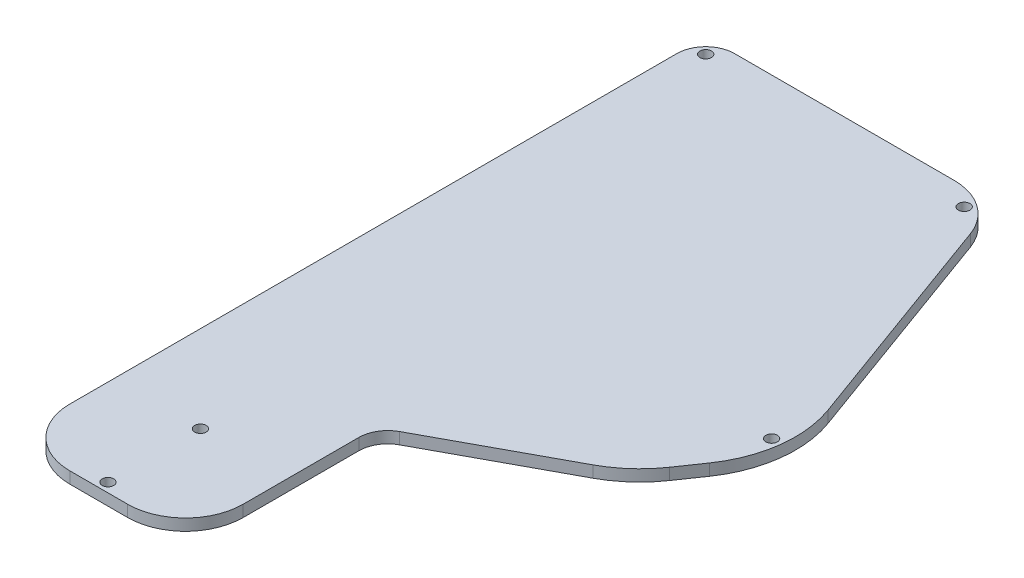
ISO-10303-21;
HEADER;
FILE_DESCRIPTION(('STEP AP214'),'2;1');
FILE_NAME('part.step','',(''),(''),'','','');
FILE_SCHEMA(('AUTOMOTIVE_DESIGN { 1 0 10303 214 1 1 1 1 }'));
ENDSEC;
DATA;
#1=APPLICATION_CONTEXT('core data for automotive mechanical design processes');
#2=APPLICATION_PROTOCOL_DEFINITION('international standard','automotive_design',2000,#1);
#3=PRODUCT_CONTEXT('',#1,'mechanical');
#4=PRODUCT('Part','Part','',(#3));
#5=PRODUCT_RELATED_PRODUCT_CATEGORY('part','',(#4));
#6=PRODUCT_DEFINITION_FORMATION('','',#4);
#7=PRODUCT_DEFINITION_CONTEXT('part definition',#1,'design');
#8=PRODUCT_DEFINITION('design','',#6,#7);
#9=PRODUCT_DEFINITION_SHAPE('','',#8);
#10=(LENGTH_UNIT() NAMED_UNIT(*) SI_UNIT(.MILLI.,.METRE.));
#11=(NAMED_UNIT(*) PLANE_ANGLE_UNIT() SI_UNIT($,.RADIAN.));
#12=(NAMED_UNIT(*) SI_UNIT($,.STERADIAN.) SOLID_ANGLE_UNIT());
#13=UNCERTAINTY_MEASURE_WITH_UNIT(LENGTH_MEASURE(1.E-05),#10,'distance_accuracy_value','');
#14=(GEOMETRIC_REPRESENTATION_CONTEXT(3) GLOBAL_UNCERTAINTY_ASSIGNED_CONTEXT((#13)) GLOBAL_UNIT_ASSIGNED_CONTEXT((#10,
#11,#12)) REPRESENTATION_CONTEXT('',''));
#15=CARTESIAN_POINT('',(0.,0.,0.));
#16=DIRECTION('',(0.,0.,1.));
#17=DIRECTION('',(1.,0.,0.));
#18=AXIS2_PLACEMENT_3D('',#15,#16,#17);
#19=CARTESIAN_POINT('',(25.4,2.54,-12.7));
#20=DIRECTION('',(0.,-1.,0.));
#21=DIRECTION('',(0.,0.,-1.));
#22=AXIS2_PLACEMENT_3D('',#19,#20,#21);
#23=CYLINDRICAL_SURFACE('',#22,12.7);
#24=CARTESIAN_POINT('',(25.4,0.,-12.7));
#25=DIRECTION('',(0.,1.,0.));
#26=DIRECTION('',(0.,0.,1.));
#27=AXIS2_PLACEMENT_3D('',#24,#25,#26);
#28=CIRCLE('',#27,12.7);
#29=CARTESIAN_POINT('',(25.3999999999999,0.,0.));
#30=VERTEX_POINT('',#29);
#31=CARTESIAN_POINT('',(38.1,0.,-12.7000000000001));
#32=VERTEX_POINT('',#31);
#33=EDGE_CURVE('E175',#30,#32,#28,.T.);
#34=ORIENTED_EDGE('',*,*,#33,.T.);
#35=DIRECTION('',(0.,-1.,0.));
#36=VECTOR('',#35,1.);
#37=CARTESIAN_POINT('',(38.1,2.54,-12.7000000000001));
#38=LINE('',#37,#36);
#39=CARTESIAN_POINT('',(38.1,2.54,-12.7000000000001));
#40=VERTEX_POINT('',#39);
#41=EDGE_CURVE('E11',#40,#32,#38,.T.);
#42=ORIENTED_EDGE('',*,*,#41,.F.);
#43=CARTESIAN_POINT('',(25.4,2.54,-12.7));
#44=DIRECTION('',(0.,1.,0.));
#45=DIRECTION('',(0.,0.,1.));
#46=AXIS2_PLACEMENT_3D('',#43,#44,#45);
#47=CIRCLE('',#46,12.7);
#48=CARTESIAN_POINT('',(25.3999999999999,2.54,0.));
#49=VERTEX_POINT('',#48);
#50=EDGE_CURVE('E202',#49,#40,#47,.T.);
#51=ORIENTED_EDGE('',*,*,#50,.F.);
#52=DIRECTION('',(0.,-1.,0.));
#53=VECTOR('',#52,1.);
#54=CARTESIAN_POINT('',(25.3999999999999,2.54,0.));
#55=LINE('',#54,#53);
#56=EDGE_CURVE('E171',#49,#30,#55,.T.);
#57=ORIENTED_EDGE('',*,*,#56,.T.);
#58=EDGE_LOOP('',(#34,#42,#51,#57));
#59=FACE_BOUND('',#58,.T.);
#60=ADVANCED_FACE('F43',(#59),#23,.T.);
#61=CARTESIAN_POINT('',(38.1,2.54,-12.7000000000001));
#62=DIRECTION('',(-1.,0.,0.));
#63=DIRECTION('',(0.,0.,1.));
#64=AXIS2_PLACEMENT_3D('',#61,#62,#63);
#65=PLANE('',#64);
#66=DIRECTION('',(0.,0.,-1.));
#67=VECTOR('',#66,1.);
#68=CARTESIAN_POINT('',(38.1,0.,-12.7000000000001));
#69=LINE('',#68,#67);
#70=CARTESIAN_POINT('',(38.1,0.,-38.1));
#71=VERTEX_POINT('',#70);
#72=EDGE_CURVE('E178',#32,#71,#69,.T.);
#73=ORIENTED_EDGE('',*,*,#72,.T.);
#74=DIRECTION('',(0.,-1.,0.));
#75=VECTOR('',#74,1.);
#76=CARTESIAN_POINT('',(38.1,2.54,-38.1));
#77=LINE('',#76,#75);
#78=CARTESIAN_POINT('',(38.1,2.54,-38.1));
#79=VERTEX_POINT('',#78);
#80=EDGE_CURVE('E51',#79,#71,#77,.T.);
#81=ORIENTED_EDGE('',*,*,#80,.F.);
#82=DIRECTION('',(0.,0.,-1.));
#83=VECTOR('',#82,1.);
#84=CARTESIAN_POINT('',(38.1,2.54,-12.7000000000001));
#85=LINE('',#84,#83);
#86=EDGE_CURVE('E120',#40,#79,#85,.T.);
#87=ORIENTED_EDGE('',*,*,#86,.F.);
#88=ORIENTED_EDGE('',*,*,#41,.T.);
#89=EDGE_LOOP('',(#73,#81,#87,#88));
#90=FACE_BOUND('',#89,.T.);
#91=ADVANCED_FACE('F291',(#90),#65,.F.);
#92=CARTESIAN_POINT('',(44.45,2.54,-38.1));
#93=DIRECTION('',(0.,-1.,0.));
#94=DIRECTION('',(0.,0.,-1.));
#95=AXIS2_PLACEMENT_3D('',#92,#93,#94);
#96=CYLINDRICAL_SURFACE('',#95,6.35);
#97=CARTESIAN_POINT('',(44.45,0.,-38.1));
#98=DIRECTION('',(0.,-1.,0.));
#99=DIRECTION('',(0.,0.,1.));
#100=AXIS2_PLACEMENT_3D('',#97,#98,#99);
#101=CIRCLE('',#100,6.35);
#102=CARTESIAN_POINT('',(41.4326368316291,0.,-43.6873087895836));
#103=VERTEX_POINT('',#102);
#104=EDGE_CURVE('E181',#71,#103,#101,.T.);
#105=ORIENTED_EDGE('',*,*,#104,.T.);
#106=DIRECTION('',(0.,-1.,0.));
#107=VECTOR('',#106,1.);
#108=CARTESIAN_POINT('',(41.4326368316291,2.54,-43.6873087895836));
#109=LINE('',#108,#107);
#110=CARTESIAN_POINT('',(41.4326368316291,2.54,-43.6873087895836));
#111=VERTEX_POINT('',#110);
#112=EDGE_CURVE('E227',#111,#103,#109,.T.);
#113=ORIENTED_EDGE('',*,*,#112,.F.);
#114=CARTESIAN_POINT('',(44.45,2.54,-38.1));
#115=DIRECTION('',(0.,-1.,0.));
#116=DIRECTION('',(0.,0.,1.));
#117=AXIS2_PLACEMENT_3D('',#114,#115,#116);
#118=CIRCLE('',#117,6.35);
#119=EDGE_CURVE('E235',#79,#111,#118,.T.);
#120=ORIENTED_EDGE('',*,*,#119,.F.);
#121=ORIENTED_EDGE('',*,*,#80,.T.);
#122=EDGE_LOOP('',(#105,#113,#120,#121));
#123=FACE_BOUND('',#122,.T.);
#124=ADVANCED_FACE('F233',(#123),#96,.F.);
#125=CARTESIAN_POINT('',(69.0224596820206,2.54,-58.5868818086818));
#126=DIRECTION('',(-0.475175302105661,0.,-0.879891147965925));
#127=DIRECTION('',(-0.879891147965926,0.,0.475175302105661));
#128=AXIS2_PLACEMENT_3D('',#125,#126,#127);
#129=PLANE('',#128);
#130=DIRECTION('',(0.879891147965925,0.,-0.475175302105661));
#131=VECTOR('',#130,1.);
#132=CARTESIAN_POINT('',(69.0224596820206,0.,-58.5868818086818));
#133=LINE('',#132,#131);
#134=CARTESIAN_POINT('',(69.0224596820206,0.,-58.5868818086818));
#135=VERTEX_POINT('',#134);
#136=EDGE_CURVE('E183',#103,#135,#133,.T.);
#137=ORIENTED_EDGE('',*,*,#136,.T.);
#138=DIRECTION('',(0.,-1.,0.));
#139=VECTOR('',#138,1.);
#140=CARTESIAN_POINT('',(69.0224596820206,2.54,-58.5868818086818));
#141=LINE('',#140,#139);
#142=CARTESIAN_POINT('',(69.0224596820206,2.54,-58.5868818086818));
#143=VERTEX_POINT('',#142);
#144=EDGE_CURVE('E224',#143,#135,#141,.T.);
#145=ORIENTED_EDGE('',*,*,#144,.F.);
#146=DIRECTION('',(0.879891147965925,0.,-0.475175302105661));
#147=VECTOR('',#146,1.);
#148=CARTESIAN_POINT('',(69.0224596820206,2.54,-58.5868818086818));
#149=LINE('',#148,#147);
#150=EDGE_CURVE('E253',#111,#143,#149,.T.);
#151=ORIENTED_EDGE('',*,*,#150,.F.);
#152=ORIENTED_EDGE('',*,*,#112,.T.);
#153=EDGE_LOOP('',(#137,#145,#151,#152));
#154=FACE_BOUND('',#153,.T.);
#155=ADVANCED_FACE('F244',(#154),#129,.F.);
#156=CARTESIAN_POINT('',(56.9530070085368,2.54,-80.9361169670163));
#157=DIRECTION('',(0.,-1.,0.));
#158=DIRECTION('',(0.,0.,-1.));
#159=AXIS2_PLACEMENT_3D('',#156,#157,#158);
#160=CYLINDRICAL_SURFACE('',#159,25.4);
#161=CARTESIAN_POINT('',(56.9530070085368,0.,-80.9361169670163));
#162=DIRECTION('',(0.,1.,0.));
#163=DIRECTION('',(0.,0.,-1.));
#164=AXIS2_PLACEMENT_3D('',#161,#162,#163);
#165=CIRCLE('',#164,25.4);
#166=CARTESIAN_POINT('',(77.8752649706461,0.,-66.5340642741897));
#167=VERTEX_POINT('',#166);
#168=EDGE_CURVE('E185',#135,#167,#165,.T.);
#169=ORIENTED_EDGE('',*,*,#168,.T.);
#170=DIRECTION('',(0.,-1.,0.));
#171=VECTOR('',#170,1.);
#172=CARTESIAN_POINT('',(77.8752649706461,2.54,-66.5340642741897));
#173=LINE('',#172,#171);
#174=CARTESIAN_POINT('',(77.8752649706461,2.54,-66.5340642741897));
#175=VERTEX_POINT('',#174);
#176=EDGE_CURVE('E221',#175,#167,#173,.T.);
#177=ORIENTED_EDGE('',*,*,#176,.F.);
#178=CARTESIAN_POINT('',(56.9530070085368,2.54,-80.9361169670163));
#179=DIRECTION('',(0.,1.,0.));
#180=DIRECTION('',(0.,0.,-1.));
#181=AXIS2_PLACEMENT_3D('',#178,#179,#180);
#182=CIRCLE('',#181,25.4);
#183=EDGE_CURVE('E250',#143,#175,#182,.T.);
#184=ORIENTED_EDGE('',*,*,#183,.F.);
#185=ORIENTED_EDGE('',*,*,#144,.T.);
#186=EDGE_LOOP('',(#169,#177,#184,#185));
#187=FACE_BOUND('',#186,.T.);
#188=ADVANCED_FACE('F248',(#187),#160,.T.);
#189=CARTESIAN_POINT('',(81.4757781438528,2.54,-71.764628764717));
#190=DIRECTION('',(-0.823710943390129,0.,-0.567009948536481));
#191=DIRECTION('',(-0.567009948536481,0.,0.823710943390129));
#192=AXIS2_PLACEMENT_3D('',#189,#190,#191);
#193=PLANE('',#192);
#194=DIRECTION('',(0.567009948536481,0.,-0.823710943390129));
#195=VECTOR('',#194,1.);
#196=CARTESIAN_POINT('',(81.4757781438528,0.,-71.764628764717));
#197=LINE('',#196,#195);
#198=CARTESIAN_POINT('',(81.4757781438528,0.,-71.764628764717));
#199=VERTEX_POINT('',#198);
#200=EDGE_CURVE('E187',#167,#199,#197,.T.);
#201=ORIENTED_EDGE('',*,*,#200,.T.);
#202=DIRECTION('',(0.,-1.,0.));
#203=VECTOR('',#202,1.);
#204=CARTESIAN_POINT('',(81.4757781438528,2.54,-71.764628764717));
#205=LINE('',#204,#203);
#206=CARTESIAN_POINT('',(81.4757781438528,2.54,-71.764628764717));
#207=VERTEX_POINT('',#206);
#208=EDGE_CURVE('E218',#207,#199,#205,.T.);
#209=ORIENTED_EDGE('',*,*,#208,.F.);
#210=DIRECTION('',(0.567009948536481,0.,-0.823710943390129));
#211=VECTOR('',#210,1.);
#212=CARTESIAN_POINT('',(81.4757781438528,2.54,-71.764628764717));
#213=LINE('',#212,#211);
#214=EDGE_CURVE('E252',#175,#207,#213,.T.);
#215=ORIENTED_EDGE('',*,*,#214,.F.);
#216=ORIENTED_EDGE('',*,*,#176,.T.);
#217=EDGE_LOOP('',(#201,#209,#215,#216));
#218=FACE_BOUND('',#217,.T.);
#219=ADVANCED_FACE('F304',(#218),#193,.F.);
#220=CARTESIAN_POINT('',(60.5535201817435,2.54,-86.1666814575436));
#221=DIRECTION('',(0.,-1.,0.));
#222=DIRECTION('',(0.,0.,-1.));
#223=AXIS2_PLACEMENT_3D('',#220,#221,#222);
#224=CYLINDRICAL_SURFACE('',#223,25.4);
#225=CARTESIAN_POINT('',(60.5535201817435,0.,-86.1666814575436));
#226=DIRECTION('',(0.,1.,0.));
#227=DIRECTION('',(0.,0.,-1.));
#228=AXIS2_PLACEMENT_3D('',#225,#226,#227);
#229=CIRCLE('',#228,25.4);
#230=CARTESIAN_POINT('',(84.4217127497056,0.,-94.8539930980156));
#231=VERTEX_POINT('',#230);
#232=EDGE_CURVE('E189',#199,#231,#229,.T.);
#233=ORIENTED_EDGE('',*,*,#232,.T.);
#234=DIRECTION('',(0.,-1.,0.));
#235=VECTOR('',#234,1.);
#236=CARTESIAN_POINT('',(84.4217127497056,2.54,-94.8539930980156));
#237=LINE('',#236,#235);
#238=CARTESIAN_POINT('',(84.4217127497056,2.54,-94.8539930980156));
#239=VERTEX_POINT('',#238);
#240=EDGE_CURVE('E215',#239,#231,#237,.T.);
#241=ORIENTED_EDGE('',*,*,#240,.F.);
#242=CARTESIAN_POINT('',(60.5535201817435,2.54,-86.1666814575436));
#243=DIRECTION('',(0.,1.,0.));
#244=DIRECTION('',(0.,0.,-1.));
#245=AXIS2_PLACEMENT_3D('',#242,#243,#244);
#246=CIRCLE('',#245,25.4);
#247=EDGE_CURVE('E255',#207,#239,#246,.T.);
#248=ORIENTED_EDGE('',*,*,#247,.F.);
#249=ORIENTED_EDGE('',*,*,#208,.T.);
#250=EDGE_LOOP('',(#233,#241,#248,#249));
#251=FACE_BOUND('',#250,.T.);
#252=ADVANCED_FACE('F307',(#251),#224,.T.);
#253=CARTESIAN_POINT('',(66.5181396852237,2.54,-144.043655820236));
#254=DIRECTION('',(-0.939692620785909,0.,0.342020143325666));
#255=DIRECTION('',(0.342020143325666,0.,0.93969262078591));
#256=AXIS2_PLACEMENT_3D('',#253,#254,#255);
#257=PLANE('',#256);
#258=DIRECTION('',(-0.342020143325666,0.,-0.939692620785909));
#259=VECTOR('',#258,1.);
#260=CARTESIAN_POINT('',(66.5181396852237,0.,-144.043655820236));
#261=LINE('',#260,#259);
#262=CARTESIAN_POINT('',(66.5181396852237,0.,-144.043655820236));
#263=VERTEX_POINT('',#262);
#264=EDGE_CURVE('E191',#231,#263,#261,.T.);
#265=ORIENTED_EDGE('',*,*,#264,.T.);
#266=DIRECTION('',(0.,-1.,0.));
#267=VECTOR('',#266,1.);
#268=CARTESIAN_POINT('',(66.5181396852237,2.54,-144.043655820236));
#269=LINE('',#268,#267);
#270=CARTESIAN_POINT('',(66.5181396852237,2.54,-144.043655820236));
#271=VERTEX_POINT('',#270);
#272=EDGE_CURVE('E212',#271,#263,#269,.T.);
#273=ORIENTED_EDGE('',*,*,#272,.F.);
#274=DIRECTION('',(-0.342020143325666,0.,-0.939692620785909));
#275=VECTOR('',#274,1.);
#276=CARTESIAN_POINT('',(66.5181396852237,2.54,-144.043655820236));
#277=LINE('',#276,#275);
#278=EDGE_CURVE('E261',#239,#271,#277,.T.);
#279=ORIENTED_EDGE('',*,*,#278,.F.);
#280=ORIENTED_EDGE('',*,*,#240,.T.);
#281=EDGE_LOOP('',(#265,#273,#279,#280));
#282=FACE_BOUND('',#281,.T.);
#283=ADVANCED_FACE('F311',(#282),#257,.F.);
#284=CARTESIAN_POINT('',(54.5840434012426,2.54,-139.7));
#285=DIRECTION('',(0.,-1.,0.));
#286=DIRECTION('',(0.,0.,-1.));
#287=AXIS2_PLACEMENT_3D('',#284,#285,#286);
#288=CYLINDRICAL_SURFACE('',#287,12.7);
#289=CARTESIAN_POINT('',(54.5840434012426,0.,-139.7));
#290=DIRECTION('',(0.,1.,0.));
#291=DIRECTION('',(0.,0.,-1.));
#292=AXIS2_PLACEMENT_3D('',#289,#290,#291);
#293=CIRCLE('',#292,12.7);
#294=CARTESIAN_POINT('',(54.5840434012426,0.,-152.4));
#295=VERTEX_POINT('',#294);
#296=EDGE_CURVE('E193',#263,#295,#293,.T.);
#297=ORIENTED_EDGE('',*,*,#296,.T.);
#298=DIRECTION('',(0.,-1.,0.));
#299=VECTOR('',#298,1.);
#300=CARTESIAN_POINT('',(54.5840434012426,2.54,-152.4));
#301=LINE('',#300,#299);
#302=CARTESIAN_POINT('',(54.5840434012426,2.54,-152.4));
#303=VERTEX_POINT('',#302);
#304=EDGE_CURVE('E209',#303,#295,#301,.T.);
#305=ORIENTED_EDGE('',*,*,#304,.F.);
#306=CARTESIAN_POINT('',(54.5840434012426,2.54,-139.7));
#307=DIRECTION('',(0.,1.,0.));
#308=DIRECTION('',(0.,0.,-1.));
#309=AXIS2_PLACEMENT_3D('',#306,#307,#308);
#310=CIRCLE('',#309,12.7);
#311=EDGE_CURVE('E263',#271,#303,#310,.T.);
#312=ORIENTED_EDGE('',*,*,#311,.F.);
#313=ORIENTED_EDGE('',*,*,#272,.T.);
#314=EDGE_LOOP('',(#297,#305,#312,#313));
#315=FACE_BOUND('',#314,.T.);
#316=ADVANCED_FACE('F315',(#315),#288,.T.);
#317=CARTESIAN_POINT('',(6.35,2.54,-152.4));
#318=DIRECTION('',(0.,0.,1.));
#319=DIRECTION('',(1.,0.,0.));
#320=AXIS2_PLACEMENT_3D('',#317,#318,#319);
#321=PLANE('',#320);
#322=DIRECTION('',(-1.,0.,0.));
#323=VECTOR('',#322,1.);
#324=CARTESIAN_POINT('',(6.35,0.,-152.4));
#325=LINE('',#324,#323);
#326=CARTESIAN_POINT('',(6.35,0.,-152.4));
#327=VERTEX_POINT('',#326);
#328=EDGE_CURVE('E195',#295,#327,#325,.T.);
#329=ORIENTED_EDGE('',*,*,#328,.T.);
#330=DIRECTION('',(0.,-1.,0.));
#331=VECTOR('',#330,1.);
#332=CARTESIAN_POINT('',(6.35,2.54,-152.4));
#333=LINE('',#332,#331);
#334=CARTESIAN_POINT('',(6.35,2.54,-152.4));
#335=VERTEX_POINT('',#334);
#336=EDGE_CURVE('E206',#335,#327,#333,.T.);
#337=ORIENTED_EDGE('',*,*,#336,.F.);
#338=DIRECTION('',(-1.,0.,0.));
#339=VECTOR('',#338,1.);
#340=CARTESIAN_POINT('',(6.35,2.54,-152.4));
#341=LINE('',#340,#339);
#342=EDGE_CURVE('E265',#303,#335,#341,.T.);
#343=ORIENTED_EDGE('',*,*,#342,.F.);
#344=ORIENTED_EDGE('',*,*,#304,.T.);
#345=EDGE_LOOP('',(#329,#337,#343,#344));
#346=FACE_BOUND('',#345,.T.);
#347=ADVANCED_FACE('F271',(#346),#321,.F.);
#348=CARTESIAN_POINT('',(6.35,2.54,-146.05));
#349=DIRECTION('',(0.,-1.,0.));
#350=DIRECTION('',(0.,0.,-1.));
#351=AXIS2_PLACEMENT_3D('',#348,#349,#350);
#352=CYLINDRICAL_SURFACE('',#351,6.34999999999998);
#353=CARTESIAN_POINT('',(6.35,0.,-146.05));
#354=DIRECTION('',(0.,1.,0.));
#355=DIRECTION('',(0.,0.,-1.));
#356=AXIS2_PLACEMENT_3D('',#353,#354,#355);
#357=CIRCLE('',#356,6.34999999999998);
#358=CARTESIAN_POINT('',(0.,0.,-146.05));
#359=VERTEX_POINT('',#358);
#360=EDGE_CURVE('E197',#327,#359,#357,.T.);
#361=ORIENTED_EDGE('',*,*,#360,.T.);
#362=DIRECTION('',(0.,-1.,0.));
#363=VECTOR('',#362,1.);
#364=CARTESIAN_POINT('',(0.,2.54,-146.05));
#365=LINE('',#364,#363);
#366=CARTESIAN_POINT('',(0.,2.54,-146.05));
#367=VERTEX_POINT('',#366);
#368=EDGE_CURVE('E166',#367,#359,#365,.T.);
#369=ORIENTED_EDGE('',*,*,#368,.F.);
#370=CARTESIAN_POINT('',(6.35,2.54,-146.05));
#371=DIRECTION('',(0.,1.,0.));
#372=DIRECTION('',(0.,0.,-1.));
#373=AXIS2_PLACEMENT_3D('',#370,#371,#372);
#374=CIRCLE('',#373,6.34999999999998);
#375=EDGE_CURVE('E157',#335,#367,#374,.T.);
#376=ORIENTED_EDGE('',*,*,#375,.F.);
#377=ORIENTED_EDGE('',*,*,#336,.T.);
#378=EDGE_LOOP('',(#361,#369,#376,#377));
#379=FACE_BOUND('',#378,.T.);
#380=ADVANCED_FACE('F275',(#379),#352,.T.);
#381=CARTESIAN_POINT('',(0.,2.54,-12.7000000000001));
#382=DIRECTION('',(1.,0.,0.));
#383=DIRECTION('',(0.,0.,-1.));
#384=AXIS2_PLACEMENT_3D('',#381,#382,#383);
#385=PLANE('',#384);
#386=DIRECTION('',(0.,0.,1.));
#387=VECTOR('',#386,1.);
#388=CARTESIAN_POINT('',(0.,0.,-12.7000000000001));
#389=LINE('',#388,#387);
#390=CARTESIAN_POINT('',(0.,0.,-12.7000000000001));
#391=VERTEX_POINT('',#390);
#392=EDGE_CURVE('E165',#359,#391,#389,.T.);
#393=ORIENTED_EDGE('',*,*,#392,.T.);
#394=DIRECTION('',(0.,-1.,0.));
#395=VECTOR('',#394,1.);
#396=CARTESIAN_POINT('',(0.,2.54,-12.7000000000001));
#397=LINE('',#396,#395);
#398=CARTESIAN_POINT('',(0.,2.54,-12.7000000000001));
#399=VERTEX_POINT('',#398);
#400=EDGE_CURVE('E162',#399,#391,#397,.T.);
#401=ORIENTED_EDGE('',*,*,#400,.F.);
#402=DIRECTION('',(0.,0.,1.));
#403=VECTOR('',#402,1.);
#404=CARTESIAN_POINT('',(0.,2.54,-12.7000000000001));
#405=LINE('',#404,#403);
#406=EDGE_CURVE('E151',#367,#399,#405,.T.);
#407=ORIENTED_EDGE('',*,*,#406,.F.);
#408=ORIENTED_EDGE('',*,*,#368,.T.);
#409=EDGE_LOOP('',(#393,#401,#407,#408));
#410=FACE_BOUND('',#409,.T.);
#411=ADVANCED_FACE('F163',(#410),#385,.F.);
#412=CARTESIAN_POINT('',(12.7,2.54,-12.7));
#413=DIRECTION('',(0.,-1.,0.));
#414=DIRECTION('',(0.,0.,-1.));
#415=AXIS2_PLACEMENT_3D('',#412,#413,#414);
#416=CYLINDRICAL_SURFACE('',#415,12.7);
#417=CARTESIAN_POINT('',(12.7,0.,-12.7));
#418=DIRECTION('',(0.,1.,0.));
#419=DIRECTION('',(0.,0.,-1.));
#420=AXIS2_PLACEMENT_3D('',#417,#418,#419);
#421=CIRCLE('',#420,12.7);
#422=CARTESIAN_POINT('',(12.7000000000001,0.,0.));
#423=VERTEX_POINT('',#422);
#424=EDGE_CURVE('E106',#391,#423,#421,.T.);
#425=ORIENTED_EDGE('',*,*,#424,.T.);
#426=DIRECTION('',(0.,-1.,0.));
#427=VECTOR('',#426,1.);
#428=CARTESIAN_POINT('',(12.7000000000001,2.54,0.));
#429=LINE('',#428,#427);
#430=CARTESIAN_POINT('',(12.7000000000001,2.54,0.));
#431=VERTEX_POINT('',#430);
#432=EDGE_CURVE('E167',#431,#423,#429,.T.);
#433=ORIENTED_EDGE('',*,*,#432,.F.);
#434=CARTESIAN_POINT('',(12.7,2.54,-12.7));
#435=DIRECTION('',(0.,1.,0.));
#436=DIRECTION('',(0.,0.,-1.));
#437=AXIS2_PLACEMENT_3D('',#434,#435,#436);
#438=CIRCLE('',#437,12.7);
#439=EDGE_CURVE('E155',#399,#431,#438,.T.);
#440=ORIENTED_EDGE('',*,*,#439,.F.);
#441=ORIENTED_EDGE('',*,*,#400,.T.);
#442=EDGE_LOOP('',(#425,#433,#440,#441));
#443=FACE_BOUND('',#442,.T.);
#444=ADVANCED_FACE('F169',(#443),#416,.T.);
#445=CARTESIAN_POINT('',(12.7000000000001,2.54,0.));
#446=DIRECTION('',(0.,0.,-1.));
#447=DIRECTION('',(-1.,0.,0.));
#448=AXIS2_PLACEMENT_3D('',#445,#446,#447);
#449=PLANE('',#448);
#450=DIRECTION('',(1.,0.,0.));
#451=VECTOR('',#450,1.);
#452=CARTESIAN_POINT('',(12.7000000000001,0.,0.));
#453=LINE('',#452,#451);
#454=EDGE_CURVE('E112',#423,#30,#453,.T.);
#455=ORIENTED_EDGE('',*,*,#454,.T.);
#456=ORIENTED_EDGE('',*,*,#56,.F.);
#457=DIRECTION('',(1.,0.,0.));
#458=VECTOR('',#457,1.);
#459=CARTESIAN_POINT('',(12.7000000000001,2.54,0.));
#460=LINE('',#459,#458);
#461=EDGE_CURVE('E59',#431,#49,#460,.T.);
#462=ORIENTED_EDGE('',*,*,#461,.F.);
#463=ORIENTED_EDGE('',*,*,#432,.T.);
#464=EDGE_LOOP('',(#455,#456,#462,#463));
#465=FACE_BOUND('',#464,.T.);
#466=ADVANCED_FACE('F279',(#465),#449,.F.);
#467=CARTESIAN_POINT('',(25.4,2.54,-12.7));
#468=DIRECTION('',(0.,1.,0.));
#469=DIRECTION('',(0.,0.,1.));
#470=AXIS2_PLACEMENT_3D('',#467,#468,#469);
#471=PLANE('',#470);
#472=CARTESIAN_POINT('',(3.302,2.54,-149.098));
#473=DIRECTION('',(0.,1.,0.));
#474=DIRECTION('',(0.,0.,1.));
#475=AXIS2_PLACEMENT_3D('',#472,#473,#474);
#476=CIRCLE('',#475,1.27000000000001);
#477=CARTESIAN_POINT('',(3.302,2.54,-147.828));
#478=VERTEX_POINT('',#477);
#479=EDGE_CURVE('E179',#478,#478,#476,.T.);
#480=ORIENTED_EDGE('',*,*,#479,.F.);
#481=EDGE_LOOP('',(#480));
#482=FACE_BOUND('',#481,.T.);
#483=CARTESIAN_POINT('',(60.7199620585743,2.54,-148.463));
#484=DIRECTION('',(0.,1.,0.));
#485=DIRECTION('',(0.,0.,1.));
#486=AXIS2_PLACEMENT_3D('',#483,#484,#485);
#487=CIRCLE('',#486,1.26999999999999);
#488=CARTESIAN_POINT('',(60.7199620585743,2.54,-147.193));
#489=VERTEX_POINT('',#488);
#490=EDGE_CURVE('E519',#489,#489,#487,.T.);
#491=ORIENTED_EDGE('',*,*,#490,.F.);
#492=EDGE_LOOP('',(#491));
#493=FACE_BOUND('',#492,.T.);
#494=CARTESIAN_POINT('',(83.6559012336225,2.54,-83.2190860696456));
#495=DIRECTION('',(0.,1.,0.));
#496=DIRECTION('',(0.,0.,1.));
#497=AXIS2_PLACEMENT_3D('',#494,#495,#496);
#498=CIRCLE('',#497,1.26999999999999);
#499=CARTESIAN_POINT('',(83.6559012336225,2.54,-81.9490860696456));
#500=VERTEX_POINT('',#499);
#501=EDGE_CURVE('E527',#500,#500,#498,.T.);
#502=ORIENTED_EDGE('',*,*,#501,.F.);
#503=EDGE_LOOP('',(#502));
#504=FACE_BOUND('',#503,.T.);
#505=CARTESIAN_POINT('',(19.05,2.54,-22.352));
#506=DIRECTION('',(0.,1.,0.));
#507=DIRECTION('',(0.,0.,1.));
#508=AXIS2_PLACEMENT_3D('',#505,#506,#507);
#509=CIRCLE('',#508,1.27);
#510=CARTESIAN_POINT('',(19.05,2.54,-21.082));
#511=VERTEX_POINT('',#510);
#512=EDGE_CURVE('E533',#511,#511,#509,.T.);
#513=ORIENTED_EDGE('',*,*,#512,.F.);
#514=EDGE_LOOP('',(#513));
#515=FACE_BOUND('',#514,.T.);
#516=CARTESIAN_POINT('',(19.05,2.54,-2.032));
#517=DIRECTION('',(0.,1.,0.));
#518=DIRECTION('',(0.,0.,1.));
#519=AXIS2_PLACEMENT_3D('',#516,#517,#518);
#520=CIRCLE('',#519,1.27);
#521=CARTESIAN_POINT('',(19.05,2.54,-0.761999999999999));
#522=VERTEX_POINT('',#521);
#523=EDGE_CURVE('E539',#522,#522,#520,.T.);
#524=ORIENTED_EDGE('',*,*,#523,.F.);
#525=EDGE_LOOP('',(#524));
#526=FACE_BOUND('',#525,.T.);
#527=ORIENTED_EDGE('',*,*,#50,.T.);
#528=ORIENTED_EDGE('',*,*,#86,.T.);
#529=ORIENTED_EDGE('',*,*,#119,.T.);
#530=ORIENTED_EDGE('',*,*,#150,.T.);
#531=ORIENTED_EDGE('',*,*,#183,.T.);
#532=ORIENTED_EDGE('',*,*,#214,.T.);
#533=ORIENTED_EDGE('',*,*,#247,.T.);
#534=ORIENTED_EDGE('',*,*,#278,.T.);
#535=ORIENTED_EDGE('',*,*,#311,.T.);
#536=ORIENTED_EDGE('',*,*,#342,.T.);
#537=ORIENTED_EDGE('',*,*,#375,.T.);
#538=ORIENTED_EDGE('',*,*,#406,.T.);
#539=ORIENTED_EDGE('',*,*,#439,.T.);
#540=ORIENTED_EDGE('',*,*,#461,.T.);
#541=EDGE_LOOP('',(#527,#528,#529,#530,#531,#532,#533,#534,#535,#536,#537,#538,#539,#540));
#542=FACE_BOUND('',#541,.T.);
#543=ADVANCED_FACE('F153',(#482,#493,#504,#515,#526,#542),#471,.T.);
#544=CARTESIAN_POINT('',(25.4,0.,-12.7));
#545=DIRECTION('',(0.,1.,0.));
#546=DIRECTION('',(0.,0.,1.));
#547=AXIS2_PLACEMENT_3D('',#544,#545,#546);
#548=PLANE('',#547);
#549=CARTESIAN_POINT('',(3.302,0.,-149.098));
#550=DIRECTION('',(0.,1.,0.));
#551=DIRECTION('',(0.,0.,1.));
#552=AXIS2_PLACEMENT_3D('',#549,#550,#551);
#553=CIRCLE('',#552,1.27000000000001);
#554=CARTESIAN_POINT('',(3.302,0.,-147.828));
#555=VERTEX_POINT('',#554);
#556=EDGE_CURVE('E514',#555,#555,#553,.T.);
#557=ORIENTED_EDGE('',*,*,#556,.T.);
#558=EDGE_LOOP('',(#557));
#559=FACE_BOUND('',#558,.T.);
#560=CARTESIAN_POINT('',(60.7199620585743,0.,-148.463));
#561=DIRECTION('',(0.,1.,0.));
#562=DIRECTION('',(0.,0.,1.));
#563=AXIS2_PLACEMENT_3D('',#560,#561,#562);
#564=CIRCLE('',#563,1.26999999999999);
#565=CARTESIAN_POINT('',(60.7199620585743,0.,-147.193));
#566=VERTEX_POINT('',#565);
#567=EDGE_CURVE('E515',#566,#566,#564,.T.);
#568=ORIENTED_EDGE('',*,*,#567,.T.);
#569=EDGE_LOOP('',(#568));
#570=FACE_BOUND('',#569,.T.);
#571=CARTESIAN_POINT('',(83.6559012336225,0.,-83.2190860696456));
#572=DIRECTION('',(0.,1.,0.));
#573=DIRECTION('',(0.,0.,1.));
#574=AXIS2_PLACEMENT_3D('',#571,#572,#573);
#575=CIRCLE('',#574,1.26999999999999);
#576=CARTESIAN_POINT('',(83.6559012336225,0.,-81.9490860696456));
#577=VERTEX_POINT('',#576);
#578=EDGE_CURVE('E524',#577,#577,#575,.T.);
#579=ORIENTED_EDGE('',*,*,#578,.T.);
#580=EDGE_LOOP('',(#579));
#581=FACE_BOUND('',#580,.T.);
#582=CARTESIAN_POINT('',(19.05,0.,-22.352));
#583=DIRECTION('',(0.,1.,0.));
#584=DIRECTION('',(0.,0.,1.));
#585=AXIS2_PLACEMENT_3D('',#582,#583,#584);
#586=CIRCLE('',#585,1.27);
#587=CARTESIAN_POINT('',(19.05,0.,-21.082));
#588=VERTEX_POINT('',#587);
#589=EDGE_CURVE('E530',#588,#588,#586,.T.);
#590=ORIENTED_EDGE('',*,*,#589,.T.);
#591=EDGE_LOOP('',(#590));
#592=FACE_BOUND('',#591,.T.);
#593=CARTESIAN_POINT('',(19.05,0.,-2.032));
#594=DIRECTION('',(0.,1.,0.));
#595=DIRECTION('',(0.,0.,1.));
#596=AXIS2_PLACEMENT_3D('',#593,#594,#595);
#597=CIRCLE('',#596,1.27);
#598=CARTESIAN_POINT('',(19.05,0.,-0.761999999999999));
#599=VERTEX_POINT('',#598);
#600=EDGE_CURVE('E536',#599,#599,#597,.T.);
#601=ORIENTED_EDGE('',*,*,#600,.T.);
#602=EDGE_LOOP('',(#601));
#603=FACE_BOUND('',#602,.T.);
#604=ORIENTED_EDGE('',*,*,#33,.F.);
#605=ORIENTED_EDGE('',*,*,#454,.F.);
#606=ORIENTED_EDGE('',*,*,#424,.F.);
#607=ORIENTED_EDGE('',*,*,#392,.F.);
#608=ORIENTED_EDGE('',*,*,#360,.F.);
#609=ORIENTED_EDGE('',*,*,#328,.F.);
#610=ORIENTED_EDGE('',*,*,#296,.F.);
#611=ORIENTED_EDGE('',*,*,#264,.F.);
#612=ORIENTED_EDGE('',*,*,#232,.F.);
#613=ORIENTED_EDGE('',*,*,#200,.F.);
#614=ORIENTED_EDGE('',*,*,#168,.F.);
#615=ORIENTED_EDGE('',*,*,#136,.F.);
#616=ORIENTED_EDGE('',*,*,#104,.F.);
#617=ORIENTED_EDGE('',*,*,#72,.F.);
#618=EDGE_LOOP('',(#604,#605,#606,#607,#608,#609,#610,#611,#612,#613,#614,#615,#616,#617));
#619=FACE_BOUND('',#618,.T.);
#620=ADVANCED_FACE('F239',(#559,#570,#581,#592,#603,#619),#548,.F.);
#621=CARTESIAN_POINT('',(19.05,2.54,-2.032));
#622=DIRECTION('',(0.,-1.,0.));
#623=DIRECTION('',(0.,0.,-1.));
#624=AXIS2_PLACEMENT_3D('',#621,#622,#623);
#625=CYLINDRICAL_SURFACE('',#624,1.27);
#626=ORIENTED_EDGE('',*,*,#523,.T.);
#627=EDGE_LOOP('',(#626));
#628=FACE_BOUND('',#627,.T.);
#629=ORIENTED_EDGE('',*,*,#600,.F.);
#630=EDGE_LOOP('',(#629));
#631=FACE_BOUND('',#630,.T.);
#632=ADVANCED_FACE('F355',(#628,#631),#625,.F.);
#633=CARTESIAN_POINT('',(19.05,2.54,-22.352));
#634=DIRECTION('',(0.,-1.,0.));
#635=DIRECTION('',(0.,0.,-1.));
#636=AXIS2_PLACEMENT_3D('',#633,#634,#635);
#637=CYLINDRICAL_SURFACE('',#636,1.27);
#638=ORIENTED_EDGE('',*,*,#512,.T.);
#639=EDGE_LOOP('',(#638));
#640=FACE_BOUND('',#639,.T.);
#641=ORIENTED_EDGE('',*,*,#589,.F.);
#642=EDGE_LOOP('',(#641));
#643=FACE_BOUND('',#642,.T.);
#644=ADVANCED_FACE('F365',(#640,#643),#637,.F.);
#645=CARTESIAN_POINT('',(83.6559012336225,2.54,-83.2190860696456));
#646=DIRECTION('',(0.,-1.,0.));
#647=DIRECTION('',(0.,0.,-1.));
#648=AXIS2_PLACEMENT_3D('',#645,#646,#647);
#649=CYLINDRICAL_SURFACE('',#648,1.26999999999999);
#650=ORIENTED_EDGE('',*,*,#501,.T.);
#651=EDGE_LOOP('',(#650));
#652=FACE_BOUND('',#651,.T.);
#653=ORIENTED_EDGE('',*,*,#578,.F.);
#654=EDGE_LOOP('',(#653));
#655=FACE_BOUND('',#654,.T.);
#656=ADVANCED_FACE('F376',(#652,#655),#649,.F.);
#657=CARTESIAN_POINT('',(60.7199620585743,2.54,-148.463));
#658=DIRECTION('',(0.,-1.,0.));
#659=DIRECTION('',(0.,0.,-1.));
#660=AXIS2_PLACEMENT_3D('',#657,#658,#659);
#661=CYLINDRICAL_SURFACE('',#660,1.26999999999999);
#662=ORIENTED_EDGE('',*,*,#490,.T.);
#663=EDGE_LOOP('',(#662));
#664=FACE_BOUND('',#663,.T.);
#665=ORIENTED_EDGE('',*,*,#567,.F.);
#666=EDGE_LOOP('',(#665));
#667=FACE_BOUND('',#666,.T.);
#668=ADVANCED_FACE('F387',(#664,#667),#661,.F.);
#669=CARTESIAN_POINT('',(3.302,2.54,-149.098));
#670=DIRECTION('',(0.,-1.,0.));
#671=DIRECTION('',(0.,0.,-1.));
#672=AXIS2_PLACEMENT_3D('',#669,#670,#671);
#673=CYLINDRICAL_SURFACE('',#672,1.27000000000001);
#674=ORIENTED_EDGE('',*,*,#479,.T.);
#675=EDGE_LOOP('',(#674));
#676=FACE_BOUND('',#675,.T.);
#677=ORIENTED_EDGE('',*,*,#556,.F.);
#678=EDGE_LOOP('',(#677));
#679=FACE_BOUND('',#678,.T.);
#680=ADVANCED_FACE('F398',(#676,#679),#673,.F.);
#681=CLOSED_SHELL('',(#60,#91,#124,#155,#188,#219,#252,#283,#316,#347,#380,#411,#444,#466,#543,
#620,#632,#644,#656,#668,#680));
#682=MANIFOLD_SOLID_BREP('B2',#681);
#683=ADVANCED_BREP_SHAPE_REPRESENTATION('',(#18,#682),#14);
#684=SHAPE_DEFINITION_REPRESENTATION(#9,#683);
ENDSEC;
END-ISO-10303-21;
